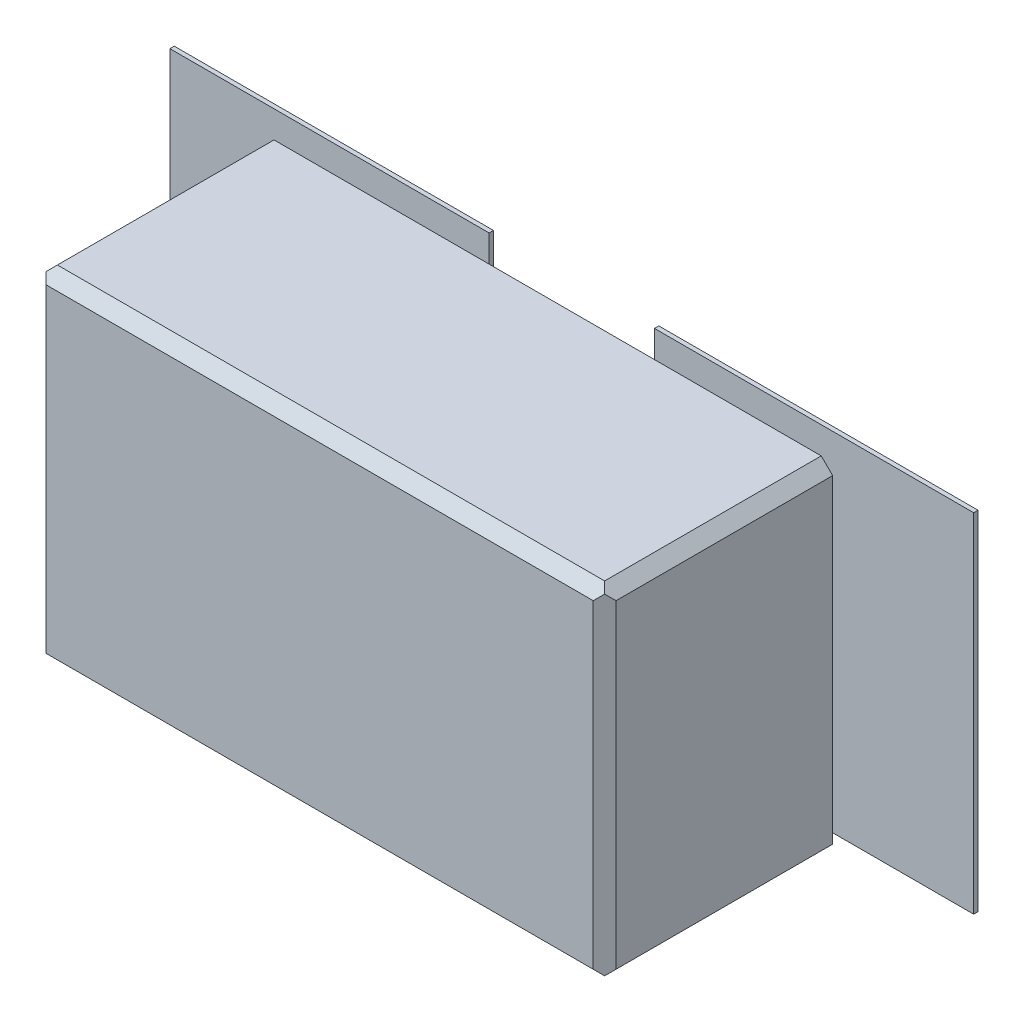
ISO-10303-21;
HEADER;
FILE_DESCRIPTION(('STEP AP214'),'2;1');
FILE_NAME('part.step','',(''),(''),'','','');
FILE_SCHEMA(('AUTOMOTIVE_DESIGN { 1 0 10303 214 1 1 1 1 }'));
ENDSEC;
DATA;
#1=APPLICATION_CONTEXT('core data for automotive mechanical design processes');
#2=APPLICATION_PROTOCOL_DEFINITION('international standard','automotive_design',2000,#1);
#3=PRODUCT_CONTEXT('',#1,'mechanical');
#4=PRODUCT('Part','Part','',(#3));
#5=PRODUCT_RELATED_PRODUCT_CATEGORY('part','',(#4));
#6=PRODUCT_DEFINITION_FORMATION('','',#4);
#7=PRODUCT_DEFINITION_CONTEXT('part definition',#1,'design');
#8=PRODUCT_DEFINITION('design','',#6,#7);
#9=PRODUCT_DEFINITION_SHAPE('','',#8);
#10=(LENGTH_UNIT() NAMED_UNIT(*) SI_UNIT(.MILLI.,.METRE.));
#11=(NAMED_UNIT(*) PLANE_ANGLE_UNIT() SI_UNIT($,.RADIAN.));
#12=(NAMED_UNIT(*) SI_UNIT($,.STERADIAN.) SOLID_ANGLE_UNIT());
#13=UNCERTAINTY_MEASURE_WITH_UNIT(LENGTH_MEASURE(1.E-05),#10,'distance_accuracy_value','');
#14=(GEOMETRIC_REPRESENTATION_CONTEXT(3) GLOBAL_UNCERTAINTY_ASSIGNED_CONTEXT((#13)) GLOBAL_UNIT_ASSIGNED_CONTEXT((#10,
#11,#12)) REPRESENTATION_CONTEXT('',''));
#15=CARTESIAN_POINT('',(0.,0.,0.));
#16=DIRECTION('',(0.,0.,1.));
#17=DIRECTION('',(1.,0.,0.));
#18=AXIS2_PLACEMENT_3D('',#15,#16,#17);
#19=CARTESIAN_POINT('',(0.,0.,0.0862));
#20=DIRECTION('',(0.,0.,-1.));
#21=DIRECTION('',(-1.,0.,0.));
#22=AXIS2_PLACEMENT_3D('',#19,#20,#21);
#23=PLANE('',#22);
#24=DIRECTION('',(1.,0.,0.));
#25=VECTOR('',#24,1.);
#26=CARTESIAN_POINT('',(-0.4159973957868,0.25,0.0862));
#27=LINE('',#26,#25);
#28=CARTESIAN_POINT('',(-0.2159973957868,0.25,0.0862));
#29=VERTEX_POINT('',#28);
#30=CARTESIAN_POINT('',(-0.4159973957868,0.25,0.0862));
#31=VERTEX_POINT('',#30);
#32=EDGE_CURVE('P0_E184',#29,#31,#27,.F.);
#33=ORIENTED_EDGE('',*,*,#32,.F.);
#34=DIRECTION('',(0.,1.,0.));
#35=VECTOR('',#34,1.);
#36=CARTESIAN_POINT('',(-0.2159973957868,0.25,0.0862));
#37=LINE('',#36,#35);
#38=CARTESIAN_POINT('',(-0.2159973957868,-0.25,0.0862));
#39=VERTEX_POINT('',#38);
#40=EDGE_CURVE('P0_E212',#39,#29,#37,.T.);
#41=ORIENTED_EDGE('',*,*,#40,.F.);
#42=DIRECTION('',(1.,0.,0.));
#43=VECTOR('',#42,1.);
#44=CARTESIAN_POINT('',(-0.2159973957868,-0.25,0.0862));
#45=LINE('',#44,#43);
#46=CARTESIAN_POINT('',(-0.4659973957868,-0.25,0.0862));
#47=VERTEX_POINT('',#46);
#48=EDGE_CURVE('P0_E163',#47,#39,#45,.T.);
#49=ORIENTED_EDGE('',*,*,#48,.F.);
#50=DIRECTION('',(0.,1.,0.));
#51=VECTOR('',#50,1.);
#52=CARTESIAN_POINT('',(-0.4659973957868,-0.25,0.0862));
#53=LINE('',#52,#51);
#54=CARTESIAN_POINT('',(-0.4659973957868,0.2,0.0862));
#55=VERTEX_POINT('',#54);
#56=EDGE_CURVE('P0_E157',#55,#47,#53,.F.);
#57=ORIENTED_EDGE('',*,*,#56,.F.);
#58=CARTESIAN_POINT('',(-0.4659973957868,0.25,0.0862));
#59=DIRECTION('',(0.,0.,-1.));
#60=DIRECTION('',(-1.,0.,0.));
#61=AXIS2_PLACEMENT_3D('',#58,#59,#60);
#62=CIRCLE('',#61,0.05);
#63=EDGE_CURVE('P0_E20',#55,#31,#62,.F.);
#64=ORIENTED_EDGE('',*,*,#63,.T.);
#65=EDGE_LOOP('',(#33,#41,#49,#57,#64));
#66=FACE_BOUND('',#65,.T.);
#67=ADVANCED_FACE('P0_F17',(#66),#23,.T.);
#68=CARTESIAN_POINT('',(0.,0.,0.0862));
#69=DIRECTION('',(0.,0.,-1.));
#70=DIRECTION('',(-1.,0.,0.));
#71=AXIS2_PLACEMENT_3D('',#68,#69,#70);
#72=PLANE('',#71);
#73=DIRECTION('',(1.,0.,0.));
#74=VECTOR('',#73,1.);
#75=CARTESIAN_POINT('',(0.1840026042132,0.25,0.0862));
#76=LINE('',#75,#74);
#77=CARTESIAN_POINT('',(0.4340026042132,0.25,0.0862));
#78=VERTEX_POINT('',#77);
#79=CARTESIAN_POINT('',(0.1840026042132,0.25,0.0862));
#80=VERTEX_POINT('',#79);
#81=EDGE_CURVE('P0_E232',#78,#80,#76,.F.);
#82=ORIENTED_EDGE('',*,*,#81,.F.);
#83=DIRECTION('',(0.,1.,0.));
#84=VECTOR('',#83,1.);
#85=CARTESIAN_POINT('',(0.4340026042132,0.25,0.0862));
#86=LINE('',#85,#84);
#87=CARTESIAN_POINT('',(0.4340026042132,-0.25,0.0862));
#88=VERTEX_POINT('',#87);
#89=EDGE_CURVE('P0_E249',#88,#78,#86,.T.);
#90=ORIENTED_EDGE('',*,*,#89,.F.);
#91=DIRECTION('',(1.,0.,0.));
#92=VECTOR('',#91,1.);
#93=CARTESIAN_POINT('',(0.4340026042132,-0.25,0.0862));
#94=LINE('',#93,#92);
#95=CARTESIAN_POINT('',(0.1840026042132,-0.25,0.0862));
#96=VERTEX_POINT('',#95);
#97=EDGE_CURVE('P0_E247',#96,#88,#94,.T.);
#98=ORIENTED_EDGE('',*,*,#97,.F.);
#99=DIRECTION('',(0.,1.,0.));
#100=VECTOR('',#99,1.);
#101=CARTESIAN_POINT('',(0.1840026042132,-0.25,0.0862));
#102=LINE('',#101,#100);
#103=EDGE_CURVE('P0_E241',#80,#96,#102,.F.);
#104=ORIENTED_EDGE('',*,*,#103,.F.);
#105=EDGE_LOOP('',(#82,#90,#98,#104));
#106=FACE_BOUND('',#105,.T.);
#107=ADVANCED_FACE('P0_F273',(#106),#72,.T.);
#108=CARTESIAN_POINT('',(-0.2159973957868,0.25,0.1262));
#109=DIRECTION('',(1.,0.,0.));
#110=DIRECTION('',(0.,0.,-1.));
#111=AXIS2_PLACEMENT_3D('',#108,#109,#110);
#112=PLANE('',#111);
#113=DIRECTION('',(0.,0.,1.));
#114=VECTOR('',#113,1.);
#115=CARTESIAN_POINT('',(-0.2159973957868,0.25,0.1262));
#116=LINE('',#115,#114);
#117=CARTESIAN_POINT('',(-0.2159973957868,0.25,0.1262));
#118=VERTEX_POINT('',#117);
#119=EDGE_CURVE('P0_E182',#118,#29,#116,.F.);
#120=ORIENTED_EDGE('',*,*,#119,.F.);
#121=DIRECTION('',(0.,1.,0.));
#122=VECTOR('',#121,1.);
#123=CARTESIAN_POINT('',(-0.2159973957868,0.,0.1262));
#124=LINE('',#123,#122);
#125=CARTESIAN_POINT('',(-0.2159973957868,-0.25,0.1262));
#126=VERTEX_POINT('',#125);
#127=EDGE_CURVE('P0_E194',#118,#126,#124,.F.);
#128=ORIENTED_EDGE('',*,*,#127,.T.);
#129=DIRECTION('',(0.,0.,-1.));
#130=VECTOR('',#129,1.);
#131=CARTESIAN_POINT('',(-0.2159973957868,-0.25,0.1262));
#132=LINE('',#131,#130);
#133=EDGE_CURVE('P0_E168',#39,#126,#132,.F.);
#134=ORIENTED_EDGE('',*,*,#133,.F.);
#135=ORIENTED_EDGE('',*,*,#40,.T.);
#136=EDGE_LOOP('',(#120,#128,#134,#135));
#137=FACE_BOUND('',#136,.T.);
#138=ADVANCED_FACE('P0_F262',(#137),#112,.T.);
#139=CARTESIAN_POINT('',(-0.2159973957868,-0.25,0.1262));
#140=DIRECTION('',(0.,-1.,0.));
#141=DIRECTION('',(0.,0.,-1.));
#142=AXIS2_PLACEMENT_3D('',#139,#140,#141);
#143=PLANE('',#142);
#144=ORIENTED_EDGE('',*,*,#133,.T.);
#145=DIRECTION('',(1.,0.,0.));
#146=VECTOR('',#145,1.);
#147=CARTESIAN_POINT('',(0.,-0.25,0.1262));
#148=LINE('',#147,#146);
#149=CARTESIAN_POINT('',(-0.4659973957868,-0.25,0.1262));
#150=VERTEX_POINT('',#149);
#151=EDGE_CURVE('P0_E196',#126,#150,#148,.F.);
#152=ORIENTED_EDGE('',*,*,#151,.T.);
#153=DIRECTION('',(0.,0.,1.));
#154=VECTOR('',#153,1.);
#155=CARTESIAN_POINT('',(-0.4659973957868,-0.25,0.1262));
#156=LINE('',#155,#154);
#157=EDGE_CURVE('P0_E167',#47,#150,#156,.T.);
#158=ORIENTED_EDGE('',*,*,#157,.F.);
#159=ORIENTED_EDGE('',*,*,#48,.T.);
#160=EDGE_LOOP('',(#144,#152,#158,#159));
#161=FACE_BOUND('',#160,.T.);
#162=ADVANCED_FACE('P0_F264',(#161),#143,.T.);
#163=CARTESIAN_POINT('',(-0.4659973957868,-0.25,0.1262));
#164=DIRECTION('',(-1.,0.,0.));
#165=DIRECTION('',(0.,0.,1.));
#166=AXIS2_PLACEMENT_3D('',#163,#164,#165);
#167=PLANE('',#166);
#168=ORIENTED_EDGE('',*,*,#157,.T.);
#169=DIRECTION('',(0.,1.,0.));
#170=VECTOR('',#169,1.);
#171=CARTESIAN_POINT('',(-0.4659973957868,0.,0.1262));
#172=LINE('',#171,#170);
#173=CARTESIAN_POINT('',(-0.4659973957868,0.2,0.1262));
#174=VERTEX_POINT('',#173);
#175=EDGE_CURVE('P0_E174',#150,#174,#172,.T.);
#176=ORIENTED_EDGE('',*,*,#175,.T.);
#177=DIRECTION('',(0.,0.,-1.));
#178=VECTOR('',#177,1.);
#179=CARTESIAN_POINT('',(-0.4659973957868,0.2,0.1262));
#180=LINE('',#179,#178);
#181=EDGE_CURVE('P0_E171',#174,#55,#180,.T.);
#182=ORIENTED_EDGE('',*,*,#181,.T.);
#183=ORIENTED_EDGE('',*,*,#56,.T.);
#184=EDGE_LOOP('',(#168,#176,#182,#183));
#185=FACE_BOUND('',#184,.T.);
#186=ADVANCED_FACE('P0_F172',(#185),#167,.T.);
#187=CARTESIAN_POINT('',(-0.4659973957868,0.25,0.1262));
#188=DIRECTION('',(0.,0.,-1.));
#189=DIRECTION('',(-1.,0.,0.));
#190=AXIS2_PLACEMENT_3D('',#187,#188,#189);
#191=CYLINDRICAL_SURFACE('',#190,0.05);
#192=ORIENTED_EDGE('',*,*,#63,.F.);
#193=ORIENTED_EDGE('',*,*,#181,.F.);
#194=CARTESIAN_POINT('',(-0.4659973957868,0.25,0.1262));
#195=DIRECTION('',(0.,0.,-1.));
#196=DIRECTION('',(-1.,0.,0.));
#197=AXIS2_PLACEMENT_3D('',#194,#195,#196);
#198=CIRCLE('',#197,0.05);
#199=CARTESIAN_POINT('',(-0.4159973957868,0.25,0.1262));
#200=VERTEX_POINT('',#199);
#201=EDGE_CURVE('P0_E220',#174,#200,#198,.F.);
#202=ORIENTED_EDGE('',*,*,#201,.T.);
#203=DIRECTION('',(0.,0.,1.));
#204=VECTOR('',#203,1.);
#205=CARTESIAN_POINT('',(-0.4159973957868,0.25,0.1262));
#206=LINE('',#205,#204);
#207=EDGE_CURVE('P0_E180',#31,#200,#206,.T.);
#208=ORIENTED_EDGE('',*,*,#207,.F.);
#209=EDGE_LOOP('',(#192,#193,#202,#208));
#210=FACE_BOUND('',#209,.T.);
#211=ADVANCED_FACE('P0_F178',(#210),#191,.F.);
#212=CARTESIAN_POINT('',(-0.4159973957868,0.25,0.1262));
#213=DIRECTION('',(0.,1.,0.));
#214=DIRECTION('',(0.,0.,1.));
#215=AXIS2_PLACEMENT_3D('',#212,#213,#214);
#216=PLANE('',#215);
#217=ORIENTED_EDGE('',*,*,#207,.T.);
#218=DIRECTION('',(1.,0.,0.));
#219=VECTOR('',#218,1.);
#220=CARTESIAN_POINT('',(0.,0.25,0.1262));
#221=LINE('',#220,#219);
#222=EDGE_CURVE('P0_E221',#200,#118,#221,.T.);
#223=ORIENTED_EDGE('',*,*,#222,.T.);
#224=ORIENTED_EDGE('',*,*,#119,.T.);
#225=ORIENTED_EDGE('',*,*,#32,.T.);
#226=EDGE_LOOP('',(#217,#223,#224,#225));
#227=FACE_BOUND('',#226,.T.);
#228=ADVANCED_FACE('P0_F254',(#227),#216,.T.);
#229=CARTESIAN_POINT('',(0.4340026042132,0.25,0.1262));
#230=DIRECTION('',(1.,0.,0.));
#231=DIRECTION('',(0.,0.,-1.));
#232=AXIS2_PLACEMENT_3D('',#229,#230,#231);
#233=PLANE('',#232);
#234=DIRECTION('',(0.,0.,1.));
#235=VECTOR('',#234,1.);
#236=CARTESIAN_POINT('',(0.4340026042132,0.25,0.1262));
#237=LINE('',#236,#235);
#238=CARTESIAN_POINT('',(0.4340026042132,0.25,0.1262));
#239=VERTEX_POINT('',#238);
#240=EDGE_CURVE('P0_E235',#239,#78,#237,.F.);
#241=ORIENTED_EDGE('',*,*,#240,.F.);
#242=DIRECTION('',(0.,1.,0.));
#243=VECTOR('',#242,1.);
#244=CARTESIAN_POINT('',(0.4340026042132,0.,0.1262));
#245=LINE('',#244,#243);
#246=CARTESIAN_POINT('',(0.4340026042132,-0.25,0.1262));
#247=VERTEX_POINT('',#246);
#248=EDGE_CURVE('P0_E222',#239,#247,#245,.F.);
#249=ORIENTED_EDGE('',*,*,#248,.T.);
#250=DIRECTION('',(0.,0.,-1.));
#251=VECTOR('',#250,1.);
#252=CARTESIAN_POINT('',(0.4340026042132,-0.25,0.1262));
#253=LINE('',#252,#251);
#254=EDGE_CURVE('P0_E244',#88,#247,#253,.F.);
#255=ORIENTED_EDGE('',*,*,#254,.F.);
#256=ORIENTED_EDGE('',*,*,#89,.T.);
#257=EDGE_LOOP('',(#241,#249,#255,#256));
#258=FACE_BOUND('',#257,.T.);
#259=ADVANCED_FACE('P0_F344',(#258),#233,.T.);
#260=CARTESIAN_POINT('',(0.4340026042132,-0.25,0.1262));
#261=DIRECTION('',(0.,-1.,0.));
#262=DIRECTION('',(0.,0.,-1.));
#263=AXIS2_PLACEMENT_3D('',#260,#261,#262);
#264=PLANE('',#263);
#265=ORIENTED_EDGE('',*,*,#254,.T.);
#266=DIRECTION('',(1.,0.,0.));
#267=VECTOR('',#266,1.);
#268=CARTESIAN_POINT('',(0.,-0.25,0.1262));
#269=LINE('',#268,#267);
#270=CARTESIAN_POINT('',(0.1840026042132,-0.25,0.1262));
#271=VERTEX_POINT('',#270);
#272=EDGE_CURVE('P0_E513',#247,#271,#269,.F.);
#273=ORIENTED_EDGE('',*,*,#272,.T.);
#274=DIRECTION('',(0.,0.,1.));
#275=VECTOR('',#274,1.);
#276=CARTESIAN_POINT('',(0.1840026042132,-0.25,0.1262));
#277=LINE('',#276,#275);
#278=EDGE_CURVE('P0_E238',#96,#271,#277,.T.);
#279=ORIENTED_EDGE('',*,*,#278,.F.);
#280=ORIENTED_EDGE('',*,*,#97,.T.);
#281=EDGE_LOOP('',(#265,#273,#279,#280));
#282=FACE_BOUND('',#281,.T.);
#283=ADVANCED_FACE('P0_F340',(#282),#264,.T.);
#284=CARTESIAN_POINT('',(0.1840026042132,-0.25,0.1262));
#285=DIRECTION('',(-1.,0.,0.));
#286=DIRECTION('',(0.,0.,1.));
#287=AXIS2_PLACEMENT_3D('',#284,#285,#286);
#288=PLANE('',#287);
#289=ORIENTED_EDGE('',*,*,#278,.T.);
#290=DIRECTION('',(0.,1.,0.));
#291=VECTOR('',#290,1.);
#292=CARTESIAN_POINT('',(0.1840026042132,0.,0.1262));
#293=LINE('',#292,#291);
#294=CARTESIAN_POINT('',(0.1840026042132,0.25,0.1262));
#295=VERTEX_POINT('',#294);
#296=EDGE_CURVE('P0_E517',#271,#295,#293,.T.);
#297=ORIENTED_EDGE('',*,*,#296,.T.);
#298=DIRECTION('',(0.,0.,1.));
#299=VECTOR('',#298,1.);
#300=CARTESIAN_POINT('',(0.1840026042132,0.25,0.1262));
#301=LINE('',#300,#299);
#302=EDGE_CURVE('P0_E197',#80,#295,#301,.T.);
#303=ORIENTED_EDGE('',*,*,#302,.F.);
#304=ORIENTED_EDGE('',*,*,#103,.T.);
#305=EDGE_LOOP('',(#289,#297,#303,#304));
#306=FACE_BOUND('',#305,.T.);
#307=ADVANCED_FACE('P0_F336',(#306),#288,.T.);
#308=CARTESIAN_POINT('',(0.1840026042132,0.25,0.1262));
#309=DIRECTION('',(0.,1.,0.));
#310=DIRECTION('',(0.,0.,1.));
#311=AXIS2_PLACEMENT_3D('',#308,#309,#310);
#312=PLANE('',#311);
#313=ORIENTED_EDGE('',*,*,#302,.T.);
#314=DIRECTION('',(1.,0.,0.));
#315=VECTOR('',#314,1.);
#316=CARTESIAN_POINT('',(0.,0.25,0.1262));
#317=LINE('',#316,#315);
#318=EDGE_CURVE('P0_E510',#295,#239,#317,.T.);
#319=ORIENTED_EDGE('',*,*,#318,.T.);
#320=ORIENTED_EDGE('',*,*,#240,.T.);
#321=ORIENTED_EDGE('',*,*,#81,.T.);
#322=EDGE_LOOP('',(#313,#319,#320,#321));
#323=FACE_BOUND('',#322,.T.);
#324=ADVANCED_FACE('P0_F332',(#323),#312,.T.);
#325=CARTESIAN_POINT('',(0.,0.,0.1262));
#326=DIRECTION('',(0.,0.,1.));
#327=DIRECTION('',(1.,0.,0.));
#328=AXIS2_PLACEMENT_3D('',#325,#326,#327);
#329=PLANE('',#328);
#330=ORIENTED_EDGE('',*,*,#296,.F.);
#331=ORIENTED_EDGE('',*,*,#272,.F.);
#332=ORIENTED_EDGE('',*,*,#248,.F.);
#333=ORIENTED_EDGE('',*,*,#318,.F.);
#334=EDGE_LOOP('',(#330,#331,#332,#333));
#335=FACE_BOUND('',#334,.T.);
#336=ORIENTED_EDGE('',*,*,#201,.F.);
#337=ORIENTED_EDGE('',*,*,#175,.F.);
#338=ORIENTED_EDGE('',*,*,#151,.F.);
#339=ORIENTED_EDGE('',*,*,#127,.F.);
#340=ORIENTED_EDGE('',*,*,#222,.F.);
#341=EDGE_LOOP('',(#336,#337,#338,#339,#340));
#342=FACE_BOUND('',#341,.T.);
#343=DIRECTION('',(0.707106781186548,0.707106781186548,0.));
#344=VECTOR('',#343,1.);
#345=CARTESIAN_POINT('',(0.49,-0.29,0.1262));
#346=LINE('',#345,#344);
#347=CARTESIAN_POINT('',(0.48,-0.3,0.1262));
#348=VERTEX_POINT('',#347);
#349=CARTESIAN_POINT('',(0.5,-0.28,0.1262));
#350=VERTEX_POINT('',#349);
#351=EDGE_CURVE('P0_E552',#348,#350,#346,.T.);
#352=ORIENTED_EDGE('',*,*,#351,.F.);
#353=DIRECTION('',(1.,0.,0.));
#354=VECTOR('',#353,1.);
#355=CARTESIAN_POINT('',(-0.5,-0.3,0.1262));
#356=LINE('',#355,#354);
#357=CARTESIAN_POINT('',(-0.48,-0.3,0.1262));
#358=VERTEX_POINT('',#357);
#359=EDGE_CURVE('P0_E542',#358,#348,#356,.T.);
#360=ORIENTED_EDGE('',*,*,#359,.F.);
#361=DIRECTION('',(0.707106781186548,-0.707106781186548,0.));
#362=VECTOR('',#361,1.);
#363=CARTESIAN_POINT('',(-0.49,-0.29,0.1262));
#364=LINE('',#363,#362);
#365=CARTESIAN_POINT('',(-0.5,-0.28,0.1262));
#366=VERTEX_POINT('',#365);
#367=EDGE_CURVE('P0_E537',#366,#358,#364,.T.);
#368=ORIENTED_EDGE('',*,*,#367,.F.);
#369=DIRECTION('',(0.,1.,0.));
#370=VECTOR('',#369,1.);
#371=CARTESIAN_POINT('',(-0.5,0.3,0.1262));
#372=LINE('',#371,#370);
#373=CARTESIAN_POINT('',(-0.5,0.28,0.1262));
#374=VERTEX_POINT('',#373);
#375=EDGE_CURVE('P0_E532',#374,#366,#372,.F.);
#376=ORIENTED_EDGE('',*,*,#375,.F.);
#377=DIRECTION('',(-0.707106781186548,-0.707106781186548,0.));
#378=VECTOR('',#377,1.);
#379=CARTESIAN_POINT('',(-0.49,0.29,0.1262));
#380=LINE('',#379,#378);
#381=CARTESIAN_POINT('',(-0.48,0.3,0.1262));
#382=VERTEX_POINT('',#381);
#383=EDGE_CURVE('P0_E527',#382,#374,#380,.T.);
#384=ORIENTED_EDGE('',*,*,#383,.F.);
#385=DIRECTION('',(1.,0.,0.));
#386=VECTOR('',#385,1.);
#387=CARTESIAN_POINT('',(0.5,0.3,0.1262));
#388=LINE('',#387,#386);
#389=CARTESIAN_POINT('',(0.48,0.3,0.1262));
#390=VERTEX_POINT('',#389);
#391=EDGE_CURVE('P0_E522',#390,#382,#388,.F.);
#392=ORIENTED_EDGE('',*,*,#391,.F.);
#393=DIRECTION('',(-0.707106781186548,0.707106781186548,0.));
#394=VECTOR('',#393,1.);
#395=CARTESIAN_POINT('',(0.49,0.29,0.1262));
#396=LINE('',#395,#394);
#397=CARTESIAN_POINT('',(0.5,0.28,0.1262));
#398=VERTEX_POINT('',#397);
#399=EDGE_CURVE('P0_E546',#398,#390,#396,.T.);
#400=ORIENTED_EDGE('',*,*,#399,.F.);
#401=DIRECTION('',(0.,1.,0.));
#402=VECTOR('',#401,1.);
#403=CARTESIAN_POINT('',(0.5,-0.3,0.1262));
#404=LINE('',#403,#402);
#405=EDGE_CURVE('P0_E557',#350,#398,#404,.T.);
#406=ORIENTED_EDGE('',*,*,#405,.F.);
#407=EDGE_LOOP('',(#352,#360,#368,#376,#384,#392,#400,#406));
#408=FACE_BOUND('',#407,.T.);
#409=ADVANCED_FACE('P0_F257',(#335,#342,#408),#329,.F.);
#410=CARTESIAN_POINT('',(0.5,0.3,0.0762));
#411=DIRECTION('',(0.,1.,0.));
#412=DIRECTION('',(0.,0.,1.));
#413=AXIS2_PLACEMENT_3D('',#410,#411,#412);
#414=PLANE('',#413);
#415=DIRECTION('',(1.,0.,0.));
#416=VECTOR('',#415,1.);
#417=CARTESIAN_POINT('',(0.,0.3,0.5062));
#418=LINE('',#417,#416);
#419=CARTESIAN_POINT('',(0.48,0.3,0.5062));
#420=VERTEX_POINT('',#419);
#421=CARTESIAN_POINT('',(-0.48,0.3,0.5062));
#422=VERTEX_POINT('',#421);
#423=EDGE_CURVE('P0_E566',#420,#422,#418,.F.);
#424=ORIENTED_EDGE('',*,*,#423,.F.);
#425=DIRECTION('',(0.,0.,1.));
#426=VECTOR('',#425,1.);
#427=CARTESIAN_POINT('',(0.48,0.3,0.3262));
#428=LINE('',#427,#426);
#429=EDGE_CURVE('P0_E544',#390,#420,#428,.T.);
#430=ORIENTED_EDGE('',*,*,#429,.F.);
#431=ORIENTED_EDGE('',*,*,#391,.T.);
#432=DIRECTION('',(0.,0.,1.));
#433=VECTOR('',#432,1.);
#434=CARTESIAN_POINT('',(-0.48,0.3,0.3262));
#435=LINE('',#434,#433);
#436=EDGE_CURVE('P0_E524',#422,#382,#435,.F.);
#437=ORIENTED_EDGE('',*,*,#436,.F.);
#438=EDGE_LOOP('',(#424,#430,#431,#437));
#439=FACE_BOUND('',#438,.T.);
#440=ADVANCED_FACE('P0_F325',(#439),#414,.T.);
#441=CARTESIAN_POINT('',(-0.49,0.29,0.3262));
#442=DIRECTION('',(-0.707106781186548,0.707106781186548,0.));
#443=DIRECTION('',(-0.707106781186548,-0.707106781186548,0.));
#444=AXIS2_PLACEMENT_3D('',#441,#442,#443);
#445=PLANE('',#444);
#446=ORIENTED_EDGE('',*,*,#436,.T.);
#447=ORIENTED_EDGE('',*,*,#383,.T.);
#448=DIRECTION('',(0.,0.,1.));
#449=VECTOR('',#448,1.);
#450=CARTESIAN_POINT('',(-0.5,0.28,0.0762));
#451=LINE('',#450,#449);
#452=CARTESIAN_POINT('',(-0.5,0.28,0.5062));
#453=VERTEX_POINT('',#452);
#454=EDGE_CURVE('P0_E529',#453,#374,#451,.F.);
#455=ORIENTED_EDGE('',*,*,#454,.F.);
#456=DIRECTION('',(-0.577350269189627,-0.577350269189624,-0.577350269189627));
#457=VECTOR('',#456,1.);
#458=CARTESIAN_POINT('',(-0.49,0.29,0.5162));
#459=LINE('',#458,#457);
#460=CARTESIAN_POINT('',(-0.49,0.29,0.5162));
#461=VERTEX_POINT('',#460);
#462=EDGE_CURVE('P0_E576',#461,#453,#459,.T.);
#463=ORIENTED_EDGE('',*,*,#462,.F.);
#464=DIRECTION('',(-0.577350269189624,-0.577350269189627,0.577350269189627));
#465=VECTOR('',#464,1.);
#466=CARTESIAN_POINT('',(-0.48,0.3,0.5062));
#467=LINE('',#466,#465);
#468=EDGE_CURVE('P0_E569',#422,#461,#467,.T.);
#469=ORIENTED_EDGE('',*,*,#468,.F.);
#470=EDGE_LOOP('',(#446,#447,#455,#463,#469));
#471=FACE_BOUND('',#470,.T.);
#472=ADVANCED_FACE('P0_F321',(#471),#445,.T.);
#473=CARTESIAN_POINT('',(-0.5,0.3,0.0762));
#474=DIRECTION('',(-1.,0.,0.));
#475=DIRECTION('',(0.,0.,1.));
#476=AXIS2_PLACEMENT_3D('',#473,#474,#475);
#477=PLANE('',#476);
#478=ORIENTED_EDGE('',*,*,#375,.T.);
#479=DIRECTION('',(0.,0.,1.));
#480=VECTOR('',#479,1.);
#481=CARTESIAN_POINT('',(-0.5,-0.28,0.3262));
#482=LINE('',#481,#480);
#483=CARTESIAN_POINT('',(-0.5,-0.28,0.5062));
#484=VERTEX_POINT('',#483);
#485=EDGE_CURVE('P0_E534',#484,#366,#482,.F.);
#486=ORIENTED_EDGE('',*,*,#485,.F.);
#487=DIRECTION('',(0.,1.,0.));
#488=VECTOR('',#487,1.);
#489=CARTESIAN_POINT('',(-0.5,0.,0.5062));
#490=LINE('',#489,#488);
#491=EDGE_CURVE('P0_E579',#453,#484,#490,.F.);
#492=ORIENTED_EDGE('',*,*,#491,.F.);
#493=ORIENTED_EDGE('',*,*,#454,.T.);
#494=EDGE_LOOP('',(#478,#486,#492,#493));
#495=FACE_BOUND('',#494,.T.);
#496=ADVANCED_FACE('P0_F317',(#495),#477,.T.);
#497=CARTESIAN_POINT('',(-0.49,-0.29,0.3262));
#498=DIRECTION('',(-0.707106781186548,-0.707106781186548,0.));
#499=DIRECTION('',(0.707106781186548,-0.707106781186548,0.));
#500=AXIS2_PLACEMENT_3D('',#497,#498,#499);
#501=PLANE('',#500);
#502=ORIENTED_EDGE('',*,*,#485,.T.);
#503=ORIENTED_EDGE('',*,*,#367,.T.);
#504=DIRECTION('',(0.,0.,-1.));
#505=VECTOR('',#504,1.);
#506=CARTESIAN_POINT('',(-0.48,-0.3,0.0762));
#507=LINE('',#506,#505);
#508=CARTESIAN_POINT('',(-0.48,-0.3,0.5062));
#509=VERTEX_POINT('',#508);
#510=EDGE_CURVE('P0_E539',#509,#358,#507,.T.);
#511=ORIENTED_EDGE('',*,*,#510,.F.);
#512=DIRECTION('',(0.577350269189624,-0.577350269189627,-0.577350269189627));
#513=VECTOR('',#512,1.);
#514=CARTESIAN_POINT('',(-0.49,-0.29,0.5162));
#515=LINE('',#514,#513);
#516=CARTESIAN_POINT('',(-0.49,-0.29,0.5162));
#517=VERTEX_POINT('',#516);
#518=EDGE_CURVE('P0_E587',#517,#509,#515,.T.);
#519=ORIENTED_EDGE('',*,*,#518,.F.);
#520=DIRECTION('',(0.577350269189627,-0.577350269189624,0.577350269189627));
#521=VECTOR('',#520,1.);
#522=CARTESIAN_POINT('',(-0.5,-0.28,0.5062));
#523=LINE('',#522,#521);
#524=EDGE_CURVE('P0_E571',#484,#517,#523,.T.);
#525=ORIENTED_EDGE('',*,*,#524,.F.);
#526=EDGE_LOOP('',(#502,#503,#511,#519,#525));
#527=FACE_BOUND('',#526,.T.);
#528=ADVANCED_FACE('P0_F313',(#527),#501,.T.);
#529=CARTESIAN_POINT('',(-0.5,-0.3,0.0762));
#530=DIRECTION('',(0.,-1.,0.));
#531=DIRECTION('',(0.,0.,-1.));
#532=AXIS2_PLACEMENT_3D('',#529,#530,#531);
#533=PLANE('',#532);
#534=ORIENTED_EDGE('',*,*,#359,.T.);
#535=DIRECTION('',(0.,0.,1.));
#536=VECTOR('',#535,1.);
#537=CARTESIAN_POINT('',(0.48,-0.3,0.3262));
#538=LINE('',#537,#536);
#539=CARTESIAN_POINT('',(0.48,-0.3,0.5062));
#540=VERTEX_POINT('',#539);
#541=EDGE_CURVE('P0_E549',#540,#348,#538,.F.);
#542=ORIENTED_EDGE('',*,*,#541,.F.);
#543=DIRECTION('',(1.,0.,0.));
#544=VECTOR('',#543,1.);
#545=CARTESIAN_POINT('',(0.,-0.3,0.5062));
#546=LINE('',#545,#544);
#547=EDGE_CURVE('P0_E590',#509,#540,#546,.T.);
#548=ORIENTED_EDGE('',*,*,#547,.F.);
#549=ORIENTED_EDGE('',*,*,#510,.T.);
#550=EDGE_LOOP('',(#534,#542,#548,#549));
#551=FACE_BOUND('',#550,.T.);
#552=ADVANCED_FACE('P0_F309',(#551),#533,.T.);
#553=CARTESIAN_POINT('',(0.49,0.29,0.3262));
#554=DIRECTION('',(0.707106781186548,0.707106781186548,0.));
#555=DIRECTION('',(-0.707106781186548,0.707106781186548,0.));
#556=AXIS2_PLACEMENT_3D('',#553,#554,#555);
#557=PLANE('',#556);
#558=DIRECTION('',(0.,0.,-1.));
#559=VECTOR('',#558,1.);
#560=CARTESIAN_POINT('',(0.5,0.28,0.0762));
#561=LINE('',#560,#559);
#562=CARTESIAN_POINT('',(0.5,0.28,0.5062));
#563=VERTEX_POINT('',#562);
#564=EDGE_CURVE('P0_E560',#398,#563,#561,.F.);
#565=ORIENTED_EDGE('',*,*,#564,.F.);
#566=ORIENTED_EDGE('',*,*,#399,.T.);
#567=ORIENTED_EDGE('',*,*,#429,.T.);
#568=DIRECTION('',(-0.577350269189624,0.577350269189627,-0.577350269189627));
#569=VECTOR('',#568,1.);
#570=CARTESIAN_POINT('',(0.49,0.29,0.5162));
#571=LINE('',#570,#569);
#572=CARTESIAN_POINT('',(0.49,0.29,0.5162));
#573=VERTEX_POINT('',#572);
#574=EDGE_CURVE('P0_E563',#573,#420,#571,.T.);
#575=ORIENTED_EDGE('',*,*,#574,.F.);
#576=DIRECTION('',(-0.577350269189627,0.577350269189624,0.577350269189627));
#577=VECTOR('',#576,1.);
#578=CARTESIAN_POINT('',(0.5,0.28,0.5062));
#579=LINE('',#578,#577);
#580=EDGE_CURVE('P0_E593',#563,#573,#579,.T.);
#581=ORIENTED_EDGE('',*,*,#580,.F.);
#582=EDGE_LOOP('',(#565,#566,#567,#575,#581));
#583=FACE_BOUND('',#582,.T.);
#584=ADVANCED_FACE('P0_F305',(#583),#557,.T.);
#585=CARTESIAN_POINT('',(0.49,-0.29,0.3262));
#586=DIRECTION('',(0.707106781186548,-0.707106781186548,0.));
#587=DIRECTION('',(0.707106781186548,0.707106781186548,0.));
#588=AXIS2_PLACEMENT_3D('',#585,#586,#587);
#589=PLANE('',#588);
#590=ORIENTED_EDGE('',*,*,#541,.T.);
#591=ORIENTED_EDGE('',*,*,#351,.T.);
#592=DIRECTION('',(0.,0.,-1.));
#593=VECTOR('',#592,1.);
#594=CARTESIAN_POINT('',(0.5,-0.28,0.0762));
#595=LINE('',#594,#593);
#596=CARTESIAN_POINT('',(0.5,-0.28,0.5062));
#597=VERTEX_POINT('',#596);
#598=EDGE_CURVE('P0_E554',#597,#350,#595,.T.);
#599=ORIENTED_EDGE('',*,*,#598,.F.);
#600=DIRECTION('',(0.577350269189627,0.577350269189624,-0.577350269189627));
#601=VECTOR('',#600,1.);
#602=CARTESIAN_POINT('',(0.49,-0.29,0.5162));
#603=LINE('',#602,#601);
#604=CARTESIAN_POINT('',(0.49,-0.29,0.5162));
#605=VERTEX_POINT('',#604);
#606=EDGE_CURVE('P0_E600',#605,#597,#603,.T.);
#607=ORIENTED_EDGE('',*,*,#606,.F.);
#608=DIRECTION('',(0.577350269189624,0.577350269189627,0.577350269189627));
#609=VECTOR('',#608,1.);
#610=CARTESIAN_POINT('',(0.48,-0.3,0.5062));
#611=LINE('',#610,#609);
#612=EDGE_CURVE('P0_E582',#540,#605,#611,.T.);
#613=ORIENTED_EDGE('',*,*,#612,.F.);
#614=EDGE_LOOP('',(#590,#591,#599,#607,#613));
#615=FACE_BOUND('',#614,.T.);
#616=ADVANCED_FACE('P0_F301',(#615),#589,.T.);
#617=CARTESIAN_POINT('',(0.5,-0.3,0.0762));
#618=DIRECTION('',(1.,0.,0.));
#619=DIRECTION('',(0.,0.,-1.));
#620=AXIS2_PLACEMENT_3D('',#617,#618,#619);
#621=PLANE('',#620);
#622=ORIENTED_EDGE('',*,*,#405,.T.);
#623=ORIENTED_EDGE('',*,*,#564,.T.);
#624=DIRECTION('',(0.,1.,0.));
#625=VECTOR('',#624,1.);
#626=CARTESIAN_POINT('',(0.5,0.,0.5062));
#627=LINE('',#626,#625);
#628=EDGE_CURVE('P0_E603',#597,#563,#627,.T.);
#629=ORIENTED_EDGE('',*,*,#628,.F.);
#630=ORIENTED_EDGE('',*,*,#598,.T.);
#631=EDGE_LOOP('',(#622,#623,#629,#630));
#632=FACE_BOUND('',#631,.T.);
#633=ADVANCED_FACE('P0_F297',(#632),#621,.T.);
#634=CARTESIAN_POINT('',(0.,0.29,0.5162));
#635=DIRECTION('',(0.,0.707106781186548,0.707106781186548));
#636=DIRECTION('',(0.,-0.707106781186548,0.707106781186548));
#637=AXIS2_PLACEMENT_3D('',#634,#635,#636);
#638=PLANE('',#637);
#639=DIRECTION('',(-0.577350269189627,0.577350269189624,-0.577350269189627));
#640=VECTOR('',#639,1.);
#641=CARTESIAN_POINT('',(-0.48,0.28,0.5262));
#642=LINE('',#641,#640);
#643=CARTESIAN_POINT('',(-0.48,0.28,0.5262));
#644=VERTEX_POINT('',#643);
#645=EDGE_CURVE('P0_E573',#644,#461,#642,.T.);
#646=ORIENTED_EDGE('',*,*,#645,.F.);
#647=DIRECTION('',(1.,0.,0.));
#648=VECTOR('',#647,1.);
#649=CARTESIAN_POINT('',(0.,0.28,0.5262));
#650=LINE('',#649,#648);
#651=CARTESIAN_POINT('',(0.48,0.28,0.5262));
#652=VERTEX_POINT('',#651);
#653=EDGE_CURVE('P0_E606',#652,#644,#650,.F.);
#654=ORIENTED_EDGE('',*,*,#653,.F.);
#655=DIRECTION('',(-0.577350269189627,-0.577350269189624,0.577350269189627));
#656=VECTOR('',#655,1.);
#657=CARTESIAN_POINT('',(0.49,0.29,0.5162));
#658=LINE('',#657,#656);
#659=EDGE_CURVE('P0_E596',#573,#652,#658,.T.);
#660=ORIENTED_EDGE('',*,*,#659,.F.);
#661=ORIENTED_EDGE('',*,*,#574,.T.);
#662=ORIENTED_EDGE('',*,*,#423,.T.);
#663=ORIENTED_EDGE('',*,*,#468,.T.);
#664=EDGE_LOOP('',(#646,#654,#660,#661,#662,#663));
#665=FACE_BOUND('',#664,.T.);
#666=ADVANCED_FACE('P0_F293',(#665),#638,.T.);
#667=CARTESIAN_POINT('',(-0.49,0.,0.5162));
#668=DIRECTION('',(-0.707106781186548,0.,0.707106781186548));
#669=DIRECTION('',(0.707106781186548,0.,0.707106781186548));
#670=AXIS2_PLACEMENT_3D('',#667,#668,#669);
#671=PLANE('',#670);
#672=ORIENTED_EDGE('',*,*,#462,.T.);
#673=ORIENTED_EDGE('',*,*,#491,.T.);
#674=ORIENTED_EDGE('',*,*,#524,.T.);
#675=DIRECTION('',(-0.577350269189624,-0.577350269189627,-0.577350269189627));
#676=VECTOR('',#675,1.);
#677=CARTESIAN_POINT('',(-0.48,-0.28,0.5262));
#678=LINE('',#677,#676);
#679=CARTESIAN_POINT('',(-0.48,-0.28,0.5262));
#680=VERTEX_POINT('',#679);
#681=EDGE_CURVE('P0_E584',#680,#517,#678,.T.);
#682=ORIENTED_EDGE('',*,*,#681,.F.);
#683=DIRECTION('',(0.,1.,0.));
#684=VECTOR('',#683,1.);
#685=CARTESIAN_POINT('',(-0.48,0.,0.5262));
#686=LINE('',#685,#684);
#687=EDGE_CURVE('P0_E609',#644,#680,#686,.F.);
#688=ORIENTED_EDGE('',*,*,#687,.F.);
#689=ORIENTED_EDGE('',*,*,#645,.T.);
#690=EDGE_LOOP('',(#672,#673,#674,#682,#688,#689));
#691=FACE_BOUND('',#690,.T.);
#692=ADVANCED_FACE('P0_F290',(#691),#671,.T.);
#693=CARTESIAN_POINT('',(0.,-0.29,0.5162));
#694=DIRECTION('',(0.,-0.707106781186548,0.707106781186548));
#695=DIRECTION('',(0.,-0.707106781186548,-0.707106781186548));
#696=AXIS2_PLACEMENT_3D('',#693,#694,#695);
#697=PLANE('',#696);
#698=ORIENTED_EDGE('',*,*,#518,.T.);
#699=ORIENTED_EDGE('',*,*,#547,.T.);
#700=ORIENTED_EDGE('',*,*,#612,.T.);
#701=DIRECTION('',(0.577350269189627,-0.577350269189624,-0.577350269189627));
#702=VECTOR('',#701,1.);
#703=CARTESIAN_POINT('',(0.48,-0.28,0.5262));
#704=LINE('',#703,#702);
#705=CARTESIAN_POINT('',(0.48,-0.28,0.5262));
#706=VERTEX_POINT('',#705);
#707=EDGE_CURVE('P0_E35',#706,#605,#704,.T.);
#708=ORIENTED_EDGE('',*,*,#707,.F.);
#709=DIRECTION('',(1.,0.,0.));
#710=VECTOR('',#709,1.);
#711=CARTESIAN_POINT('',(0.,-0.28,0.5262));
#712=LINE('',#711,#710);
#713=EDGE_CURVE('P0_E26',#680,#706,#712,.T.);
#714=ORIENTED_EDGE('',*,*,#713,.F.);
#715=ORIENTED_EDGE('',*,*,#681,.T.);
#716=EDGE_LOOP('',(#698,#699,#700,#708,#714,#715));
#717=FACE_BOUND('',#716,.T.);
#718=ADVANCED_FACE('P0_F283',(#717),#697,.T.);
#719=CARTESIAN_POINT('',(0.49,0.,0.5162));
#720=DIRECTION('',(0.707106781186548,0.,0.707106781186548));
#721=DIRECTION('',(0.707106781186548,0.,-0.707106781186548));
#722=AXIS2_PLACEMENT_3D('',#719,#720,#721);
#723=PLANE('',#722);
#724=ORIENTED_EDGE('',*,*,#606,.T.);
#725=ORIENTED_EDGE('',*,*,#628,.T.);
#726=ORIENTED_EDGE('',*,*,#580,.T.);
#727=ORIENTED_EDGE('',*,*,#659,.T.);
#728=DIRECTION('',(0.,1.,0.));
#729=VECTOR('',#728,1.);
#730=CARTESIAN_POINT('',(0.48,0.,0.5262));
#731=LINE('',#730,#729);
#732=EDGE_CURVE('P0_E11',#706,#652,#731,.T.);
#733=ORIENTED_EDGE('',*,*,#732,.F.);
#734=ORIENTED_EDGE('',*,*,#707,.T.);
#735=EDGE_LOOP('',(#724,#725,#726,#727,#733,#734));
#736=FACE_BOUND('',#735,.T.);
#737=ADVANCED_FACE('P0_F277',(#736),#723,.T.);
#738=CARTESIAN_POINT('',(0.,0.,0.5262));
#739=DIRECTION('',(0.,0.,1.));
#740=DIRECTION('',(1.,0.,0.));
#741=AXIS2_PLACEMENT_3D('',#738,#739,#740);
#742=PLANE('',#741);
#743=ORIENTED_EDGE('',*,*,#713,.T.);
#744=ORIENTED_EDGE('',*,*,#732,.T.);
#745=ORIENTED_EDGE('',*,*,#653,.T.);
#746=ORIENTED_EDGE('',*,*,#687,.T.);
#747=EDGE_LOOP('',(#743,#744,#745,#746));
#748=FACE_BOUND('',#747,.T.);
#749=ADVANCED_FACE('P0_F275',(#748),#742,.T.);
#750=CLOSED_SHELL('',(#67,#107,#138,#162,#186,#211,#228,#259,#283,#307,#324,#409,#440,#472,#496,
#528,#552,#584,#616,#633,#666,#692,#718,#737,#749));
#751=MANIFOLD_SOLID_BREP('P0_B1',#750);
#752=CARTESIAN_POINT('',(0.,0.,0.08382));
#753=DIRECTION('',(0.,0.,1.));
#754=DIRECTION('',(1.,0.,0.));
#755=AXIS2_PLACEMENT_3D('',#752,#753,#754);
#756=PLANE('',#755);
#757=DIRECTION('',(0.,1.,0.));
#758=VECTOR('',#757,1.);
#759=CARTESIAN_POINT('',(-0.705,0.305,0.08382));
#760=LINE('',#759,#758);
#761=CARTESIAN_POINT('',(-0.705,-0.305,0.08382));
#762=VERTEX_POINT('',#761);
#763=CARTESIAN_POINT('',(-0.705,0.305,0.08382));
#764=VERTEX_POINT('',#763);
#765=EDGE_CURVE('P1_E68',#762,#764,#760,.T.);
#766=ORIENTED_EDGE('',*,*,#765,.F.);
#767=DIRECTION('',(1.,0.,0.));
#768=VECTOR('',#767,1.);
#769=CARTESIAN_POINT('',(-0.705,-0.305,0.08382));
#770=LINE('',#769,#768);
#771=CARTESIAN_POINT('',(-0.145,-0.305,0.08382));
#772=VERTEX_POINT('',#771);
#773=EDGE_CURVE('P1_E20',#772,#762,#770,.F.);
#774=ORIENTED_EDGE('',*,*,#773,.F.);
#775=DIRECTION('',(0.,1.,0.));
#776=VECTOR('',#775,1.);
#777=CARTESIAN_POINT('',(-0.145,-0.305,0.08382));
#778=LINE('',#777,#776);
#779=CARTESIAN_POINT('',(-0.145,0.305,0.08382));
#780=VERTEX_POINT('',#779);
#781=EDGE_CURVE('P1_E58',#780,#772,#778,.F.);
#782=ORIENTED_EDGE('',*,*,#781,.F.);
#783=DIRECTION('',(1.,0.,0.));
#784=VECTOR('',#783,1.);
#785=CARTESIAN_POINT('',(-0.145,0.305,0.08382));
#786=LINE('',#785,#784);
#787=EDGE_CURVE('P1_E53',#764,#780,#786,.T.);
#788=ORIENTED_EDGE('',*,*,#787,.F.);
#789=EDGE_LOOP('',(#766,#774,#782,#788));
#790=FACE_BOUND('',#789,.T.);
#791=ADVANCED_FACE('P1_F17',(#790),#756,.T.);
#792=CARTESIAN_POINT('',(-0.705,-0.305,0.0762));
#793=DIRECTION('',(0.,-1.,0.));
#794=DIRECTION('',(0.,0.,-1.));
#795=AXIS2_PLACEMENT_3D('',#792,#793,#794);
#796=PLANE('',#795);
#797=DIRECTION('',(0.,0.,1.));
#798=VECTOR('',#797,1.);
#799=CARTESIAN_POINT('',(-0.705,-0.305,0.0762));
#800=LINE('',#799,#798);
#801=CARTESIAN_POINT('',(-0.705,-0.305,0.0762));
#802=VERTEX_POINT('',#801);
#803=EDGE_CURVE('P1_E79',#802,#762,#800,.T.);
#804=ORIENTED_EDGE('',*,*,#803,.F.);
#805=DIRECTION('',(1.,0.,0.));
#806=VECTOR('',#805,1.);
#807=CARTESIAN_POINT('',(0.,-0.305,0.0762));
#808=LINE('',#807,#806);
#809=CARTESIAN_POINT('',(-0.145,-0.305,0.0762));
#810=VERTEX_POINT('',#809);
#811=EDGE_CURVE('P1_E74',#802,#810,#808,.T.);
#812=ORIENTED_EDGE('',*,*,#811,.T.);
#813=DIRECTION('',(0.,0.,-1.));
#814=VECTOR('',#813,1.);
#815=CARTESIAN_POINT('',(-0.145,-0.305,0.0762));
#816=LINE('',#815,#814);
#817=EDGE_CURVE('P1_E63',#772,#810,#816,.T.);
#818=ORIENTED_EDGE('',*,*,#817,.F.);
#819=ORIENTED_EDGE('',*,*,#773,.T.);
#820=EDGE_LOOP('',(#804,#812,#818,#819));
#821=FACE_BOUND('',#820,.T.);
#822=ADVANCED_FACE('P1_F73',(#821),#796,.T.);
#823=CARTESIAN_POINT('',(-0.145,-0.305,0.0762));
#824=DIRECTION('',(1.,0.,0.));
#825=DIRECTION('',(0.,0.,-1.));
#826=AXIS2_PLACEMENT_3D('',#823,#824,#825);
#827=PLANE('',#826);
#828=ORIENTED_EDGE('',*,*,#817,.T.);
#829=DIRECTION('',(0.,1.,0.));
#830=VECTOR('',#829,1.);
#831=CARTESIAN_POINT('',(-0.145,0.,0.0762));
#832=LINE('',#831,#830);
#833=CARTESIAN_POINT('',(-0.145,0.305,0.0762));
#834=VERTEX_POINT('',#833);
#835=EDGE_CURVE('P1_E84',#810,#834,#832,.T.);
#836=ORIENTED_EDGE('',*,*,#835,.T.);
#837=DIRECTION('',(0.,0.,1.));
#838=VECTOR('',#837,1.);
#839=CARTESIAN_POINT('',(-0.145,0.305,0.0762));
#840=LINE('',#839,#838);
#841=EDGE_CURVE('P1_E65',#780,#834,#840,.F.);
#842=ORIENTED_EDGE('',*,*,#841,.F.);
#843=ORIENTED_EDGE('',*,*,#781,.T.);
#844=EDGE_LOOP('',(#828,#836,#842,#843));
#845=FACE_BOUND('',#844,.T.);
#846=ADVANCED_FACE('P1_F60',(#845),#827,.T.);
#847=CARTESIAN_POINT('',(-0.145,0.305,0.0762));
#848=DIRECTION('',(0.,1.,0.));
#849=DIRECTION('',(0.,0.,1.));
#850=AXIS2_PLACEMENT_3D('',#847,#848,#849);
#851=PLANE('',#850);
#852=ORIENTED_EDGE('',*,*,#841,.T.);
#853=DIRECTION('',(1.,0.,0.));
#854=VECTOR('',#853,1.);
#855=CARTESIAN_POINT('',(0.,0.305,0.0762));
#856=LINE('',#855,#854);
#857=CARTESIAN_POINT('',(-0.705,0.305,0.0762));
#858=VERTEX_POINT('',#857);
#859=EDGE_CURVE('P1_E26',#834,#858,#856,.F.);
#860=ORIENTED_EDGE('',*,*,#859,.T.);
#861=DIRECTION('',(0.,0.,1.));
#862=VECTOR('',#861,1.);
#863=CARTESIAN_POINT('',(-0.705,0.305,0.0762));
#864=LINE('',#863,#862);
#865=EDGE_CURVE('P1_E34',#764,#858,#864,.F.);
#866=ORIENTED_EDGE('',*,*,#865,.F.);
#867=ORIENTED_EDGE('',*,*,#787,.T.);
#868=EDGE_LOOP('',(#852,#860,#866,#867));
#869=FACE_BOUND('',#868,.T.);
#870=ADVANCED_FACE('P1_F88',(#869),#851,.T.);
#871=CARTESIAN_POINT('',(-0.705,0.305,0.0762));
#872=DIRECTION('',(-1.,0.,0.));
#873=DIRECTION('',(0.,0.,1.));
#874=AXIS2_PLACEMENT_3D('',#871,#872,#873);
#875=PLANE('',#874);
#876=ORIENTED_EDGE('',*,*,#865,.T.);
#877=DIRECTION('',(0.,1.,0.));
#878=VECTOR('',#877,1.);
#879=CARTESIAN_POINT('',(-0.705,0.,0.0762));
#880=LINE('',#879,#878);
#881=EDGE_CURVE('P1_E11',#858,#802,#880,.F.);
#882=ORIENTED_EDGE('',*,*,#881,.T.);
#883=ORIENTED_EDGE('',*,*,#803,.T.);
#884=ORIENTED_EDGE('',*,*,#765,.T.);
#885=EDGE_LOOP('',(#876,#882,#883,#884));
#886=FACE_BOUND('',#885,.T.);
#887=ADVANCED_FACE('P1_F91',(#886),#875,.T.);
#888=CARTESIAN_POINT('',(0.,0.,0.0762));
#889=DIRECTION('',(0.,0.,1.));
#890=DIRECTION('',(1.,0.,0.));
#891=AXIS2_PLACEMENT_3D('',#888,#889,#890);
#892=PLANE('',#891);
#893=ORIENTED_EDGE('',*,*,#859,.F.);
#894=ORIENTED_EDGE('',*,*,#835,.F.);
#895=ORIENTED_EDGE('',*,*,#811,.F.);
#896=ORIENTED_EDGE('',*,*,#881,.F.);
#897=EDGE_LOOP('',(#893,#894,#895,#896));
#898=FACE_BOUND('',#897,.T.);
#899=ADVANCED_FACE('P1_F90',(#898),#892,.F.);
#900=CLOSED_SHELL('',(#791,#822,#846,#870,#887,#899));
#901=MANIFOLD_SOLID_BREP('P1_B1',#900);
#902=CARTESIAN_POINT('',(0.,0.,0.08382));
#903=DIRECTION('',(0.,0.,1.));
#904=DIRECTION('',(1.,0.,0.));
#905=AXIS2_PLACEMENT_3D('',#902,#903,#904);
#906=PLANE('',#905);
#907=DIRECTION('',(0.,1.,0.));
#908=VECTOR('',#907,1.);
#909=CARTESIAN_POINT('',(0.145,0.305,0.08382));
#910=LINE('',#909,#908);
#911=CARTESIAN_POINT('',(0.145,-0.305,0.08382));
#912=VERTEX_POINT('',#911);
#913=CARTESIAN_POINT('',(0.145,0.305,0.08382));
#914=VERTEX_POINT('',#913);
#915=EDGE_CURVE('P2_E68',#912,#914,#910,.T.);
#916=ORIENTED_EDGE('',*,*,#915,.F.);
#917=DIRECTION('',(1.,0.,0.));
#918=VECTOR('',#917,1.);
#919=CARTESIAN_POINT('',(0.145,-0.305,0.08382));
#920=LINE('',#919,#918);
#921=CARTESIAN_POINT('',(0.705,-0.305,0.08382));
#922=VERTEX_POINT('',#921);
#923=EDGE_CURVE('P2_E20',#922,#912,#920,.F.);
#924=ORIENTED_EDGE('',*,*,#923,.F.);
#925=DIRECTION('',(0.,1.,0.));
#926=VECTOR('',#925,1.);
#927=CARTESIAN_POINT('',(0.705,-0.305,0.08382));
#928=LINE('',#927,#926);
#929=CARTESIAN_POINT('',(0.705,0.305,0.08382));
#930=VERTEX_POINT('',#929);
#931=EDGE_CURVE('P2_E58',#930,#922,#928,.F.);
#932=ORIENTED_EDGE('',*,*,#931,.F.);
#933=DIRECTION('',(1.,0.,0.));
#934=VECTOR('',#933,1.);
#935=CARTESIAN_POINT('',(0.705,0.305,0.08382));
#936=LINE('',#935,#934);
#937=EDGE_CURVE('P2_E53',#914,#930,#936,.T.);
#938=ORIENTED_EDGE('',*,*,#937,.F.);
#939=EDGE_LOOP('',(#916,#924,#932,#938));
#940=FACE_BOUND('',#939,.T.);
#941=ADVANCED_FACE('P2_F17',(#940),#906,.T.);
#942=CARTESIAN_POINT('',(0.145,-0.305,0.0762));
#943=DIRECTION('',(0.,-1.,0.));
#944=DIRECTION('',(0.,0.,-1.));
#945=AXIS2_PLACEMENT_3D('',#942,#943,#944);
#946=PLANE('',#945);
#947=DIRECTION('',(0.,0.,1.));
#948=VECTOR('',#947,1.);
#949=CARTESIAN_POINT('',(0.145,-0.305,0.0762));
#950=LINE('',#949,#948);
#951=CARTESIAN_POINT('',(0.145,-0.305,0.0762));
#952=VERTEX_POINT('',#951);
#953=EDGE_CURVE('P2_E79',#952,#912,#950,.T.);
#954=ORIENTED_EDGE('',*,*,#953,.F.);
#955=DIRECTION('',(1.,0.,0.));
#956=VECTOR('',#955,1.);
#957=CARTESIAN_POINT('',(0.,-0.305,0.0762));
#958=LINE('',#957,#956);
#959=CARTESIAN_POINT('',(0.705,-0.305,0.0762));
#960=VERTEX_POINT('',#959);
#961=EDGE_CURVE('P2_E74',#952,#960,#958,.T.);
#962=ORIENTED_EDGE('',*,*,#961,.T.);
#963=DIRECTION('',(0.,0.,-1.));
#964=VECTOR('',#963,1.);
#965=CARTESIAN_POINT('',(0.705,-0.305,0.0762));
#966=LINE('',#965,#964);
#967=EDGE_CURVE('P2_E63',#922,#960,#966,.T.);
#968=ORIENTED_EDGE('',*,*,#967,.F.);
#969=ORIENTED_EDGE('',*,*,#923,.T.);
#970=EDGE_LOOP('',(#954,#962,#968,#969));
#971=FACE_BOUND('',#970,.T.);
#972=ADVANCED_FACE('P2_F73',(#971),#946,.T.);
#973=CARTESIAN_POINT('',(0.705,-0.305,0.0762));
#974=DIRECTION('',(1.,0.,0.));
#975=DIRECTION('',(0.,0.,-1.));
#976=AXIS2_PLACEMENT_3D('',#973,#974,#975);
#977=PLANE('',#976);
#978=ORIENTED_EDGE('',*,*,#967,.T.);
#979=DIRECTION('',(0.,1.,0.));
#980=VECTOR('',#979,1.);
#981=CARTESIAN_POINT('',(0.705,0.,0.0762));
#982=LINE('',#981,#980);
#983=CARTESIAN_POINT('',(0.705,0.305,0.0762));
#984=VERTEX_POINT('',#983);
#985=EDGE_CURVE('P2_E84',#960,#984,#982,.T.);
#986=ORIENTED_EDGE('',*,*,#985,.T.);
#987=DIRECTION('',(0.,0.,1.));
#988=VECTOR('',#987,1.);
#989=CARTESIAN_POINT('',(0.705,0.305,0.0762));
#990=LINE('',#989,#988);
#991=EDGE_CURVE('P2_E65',#930,#984,#990,.F.);
#992=ORIENTED_EDGE('',*,*,#991,.F.);
#993=ORIENTED_EDGE('',*,*,#931,.T.);
#994=EDGE_LOOP('',(#978,#986,#992,#993));
#995=FACE_BOUND('',#994,.T.);
#996=ADVANCED_FACE('P2_F60',(#995),#977,.T.);
#997=CARTESIAN_POINT('',(0.705,0.305,0.0762));
#998=DIRECTION('',(0.,1.,0.));
#999=DIRECTION('',(0.,0.,1.));
#1000=AXIS2_PLACEMENT_3D('',#997,#998,#999);
#1001=PLANE('',#1000);
#1002=ORIENTED_EDGE('',*,*,#991,.T.);
#1003=DIRECTION('',(1.,0.,0.));
#1004=VECTOR('',#1003,1.);
#1005=CARTESIAN_POINT('',(0.,0.305,0.0762));
#1006=LINE('',#1005,#1004);
#1007=CARTESIAN_POINT('',(0.145,0.305,0.0762));
#1008=VERTEX_POINT('',#1007);
#1009=EDGE_CURVE('P2_E26',#984,#1008,#1006,.F.);
#1010=ORIENTED_EDGE('',*,*,#1009,.T.);
#1011=DIRECTION('',(0.,0.,1.));
#1012=VECTOR('',#1011,1.);
#1013=CARTESIAN_POINT('',(0.145,0.305,0.0762));
#1014=LINE('',#1013,#1012);
#1015=EDGE_CURVE('P2_E34',#914,#1008,#1014,.F.);
#1016=ORIENTED_EDGE('',*,*,#1015,.F.);
#1017=ORIENTED_EDGE('',*,*,#937,.T.);
#1018=EDGE_LOOP('',(#1002,#1010,#1016,#1017));
#1019=FACE_BOUND('',#1018,.T.);
#1020=ADVANCED_FACE('P2_F88',(#1019),#1001,.T.);
#1021=CARTESIAN_POINT('',(0.145,0.305,0.0762));
#1022=DIRECTION('',(-1.,0.,0.));
#1023=DIRECTION('',(0.,0.,1.));
#1024=AXIS2_PLACEMENT_3D('',#1021,#1022,#1023);
#1025=PLANE('',#1024);
#1026=ORIENTED_EDGE('',*,*,#1015,.T.);
#1027=DIRECTION('',(0.,1.,0.));
#1028=VECTOR('',#1027,1.);
#1029=CARTESIAN_POINT('',(0.145,0.,0.0762));
#1030=LINE('',#1029,#1028);
#1031=EDGE_CURVE('P2_E11',#1008,#952,#1030,.F.);
#1032=ORIENTED_EDGE('',*,*,#1031,.T.);
#1033=ORIENTED_EDGE('',*,*,#953,.T.);
#1034=ORIENTED_EDGE('',*,*,#915,.T.);
#1035=EDGE_LOOP('',(#1026,#1032,#1033,#1034));
#1036=FACE_BOUND('',#1035,.T.);
#1037=ADVANCED_FACE('P2_F91',(#1036),#1025,.T.);
#1038=CARTESIAN_POINT('',(0.,0.,0.0762));
#1039=DIRECTION('',(0.,0.,1.));
#1040=DIRECTION('',(1.,0.,0.));
#1041=AXIS2_PLACEMENT_3D('',#1038,#1039,#1040);
#1042=PLANE('',#1041);
#1043=ORIENTED_EDGE('',*,*,#1009,.F.);
#1044=ORIENTED_EDGE('',*,*,#985,.F.);
#1045=ORIENTED_EDGE('',*,*,#961,.F.);
#1046=ORIENTED_EDGE('',*,*,#1031,.F.);
#1047=EDGE_LOOP('',(#1043,#1044,#1045,#1046));
#1048=FACE_BOUND('',#1047,.T.);
#1049=ADVANCED_FACE('P2_F90',(#1048),#1042,.F.);
#1050=CLOSED_SHELL('',(#941,#972,#996,#1020,#1037,#1049));
#1051=MANIFOLD_SOLID_BREP('P2_B1',#1050);
#1052=ADVANCED_BREP_SHAPE_REPRESENTATION('',(#18,#751,#901,#1051),#14);
#1053=SHAPE_DEFINITION_REPRESENTATION(#9,#1052);
ENDSEC;
END-ISO-10303-21;
